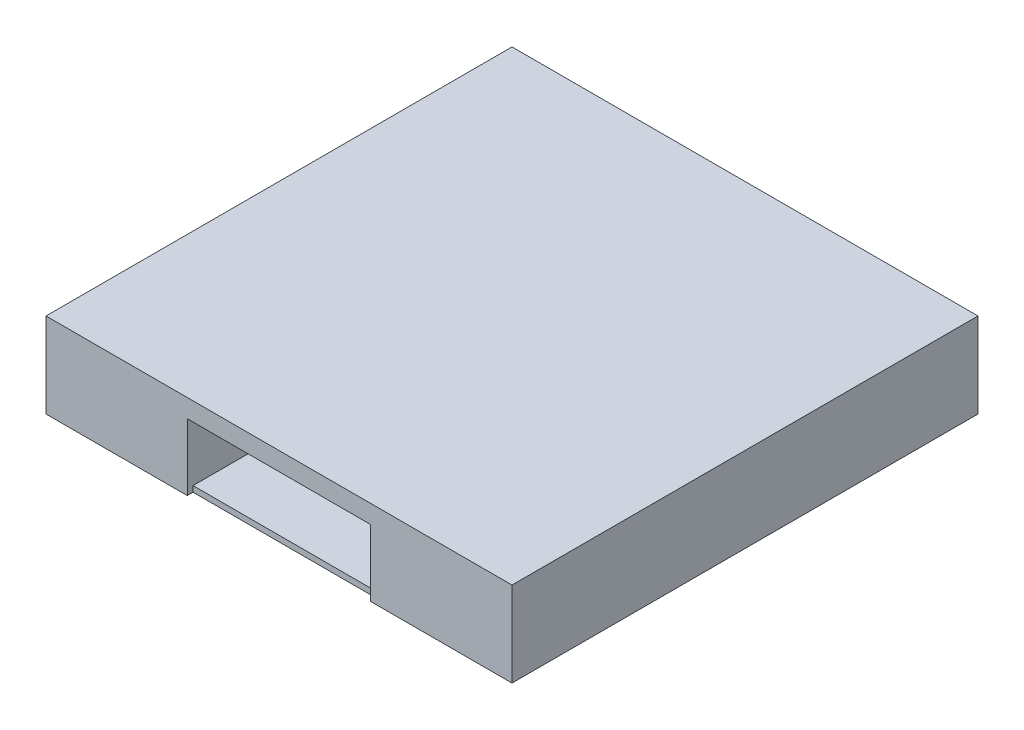
ISO-10303-21;
HEADER;
FILE_DESCRIPTION(('STEP AP214'),'2;1');
FILE_NAME('part.step','',(''),(''),'','','');
FILE_SCHEMA(('AUTOMOTIVE_DESIGN { 1 0 10303 214 1 1 1 1 }'));
ENDSEC;
DATA;
#1=APPLICATION_CONTEXT('core data for automotive mechanical design processes');
#2=APPLICATION_PROTOCOL_DEFINITION('international standard','automotive_design',2000,#1);
#3=PRODUCT_CONTEXT('',#1,'mechanical');
#4=PRODUCT('Part','Part','',(#3));
#5=PRODUCT_RELATED_PRODUCT_CATEGORY('part','',(#4));
#6=PRODUCT_DEFINITION_FORMATION('','',#4);
#7=PRODUCT_DEFINITION_CONTEXT('part definition',#1,'design');
#8=PRODUCT_DEFINITION('design','',#6,#7);
#9=PRODUCT_DEFINITION_SHAPE('','',#8);
#10=(LENGTH_UNIT() NAMED_UNIT(*) SI_UNIT(.MILLI.,.METRE.));
#11=(NAMED_UNIT(*) PLANE_ANGLE_UNIT() SI_UNIT($,.RADIAN.));
#12=(NAMED_UNIT(*) SI_UNIT($,.STERADIAN.) SOLID_ANGLE_UNIT());
#13=UNCERTAINTY_MEASURE_WITH_UNIT(LENGTH_MEASURE(1.E-05),#10,'distance_accuracy_value','');
#14=(GEOMETRIC_REPRESENTATION_CONTEXT(3) GLOBAL_UNCERTAINTY_ASSIGNED_CONTEXT((#13)) GLOBAL_UNIT_ASSIGNED_CONTEXT((#10,
#11,#12)) REPRESENTATION_CONTEXT('',''));
#15=CARTESIAN_POINT('',(0.,0.,0.));
#16=DIRECTION('',(0.,0.,1.));
#17=DIRECTION('',(1.,0.,0.));
#18=AXIS2_PLACEMENT_3D('',#15,#16,#17);
#19=CARTESIAN_POINT('',(0.,6.3,0.));
#20=DIRECTION('',(0.,-1.,0.));
#21=DIRECTION('',(0.,0.,-1.));
#22=AXIS2_PLACEMENT_3D('',#19,#20,#21);
#23=PLANE('',#22);
#24=DIRECTION('',(1.,0.,0.));
#25=VECTOR('',#24,1.);
#26=CARTESIAN_POINT('',(6.3,6.3,-6.3));
#27=LINE('',#26,#25);
#28=CARTESIAN_POINT('',(154.,6.3,-6.3));
#29=VERTEX_POINT('',#28);
#30=CARTESIAN_POINT('',(354.,6.3,-6.3));
#31=VERTEX_POINT('',#30);
#32=EDGE_CURVE('E220',#29,#31,#27,.T.);
#33=ORIENTED_EDGE('',*,*,#32,.T.);
#34=DIRECTION('',(0.,0.,-1.));
#35=VECTOR('',#34,1.);
#36=CARTESIAN_POINT('',(354.,6.3,0.));
#37=LINE('',#36,#35);
#38=CARTESIAN_POINT('',(354.,6.3,-501.7));
#39=VERTEX_POINT('',#38);
#40=EDGE_CURVE('E560',#31,#39,#37,.T.);
#41=ORIENTED_EDGE('',*,*,#40,.T.);
#42=DIRECTION('',(-1.,0.,0.));
#43=VECTOR('',#42,1.);
#44=CARTESIAN_POINT('',(501.7,6.3,-501.7));
#45=LINE('',#44,#43);
#46=CARTESIAN_POINT('',(154.,6.3,-501.7));
#47=VERTEX_POINT('',#46);
#48=EDGE_CURVE('E226',#39,#47,#45,.T.);
#49=ORIENTED_EDGE('',*,*,#48,.T.);
#50=DIRECTION('',(0.,0.,1.));
#51=VECTOR('',#50,1.);
#52=CARTESIAN_POINT('',(154.,6.3,0.));
#53=LINE('',#52,#51);
#54=EDGE_CURVE('E563',#47,#29,#53,.T.);
#55=ORIENTED_EDGE('',*,*,#54,.T.);
#56=EDGE_LOOP('',(#33,#41,#49,#55));
#57=FACE_BOUND('',#56,.T.);
#58=ADVANCED_FACE('F36',(#57),#23,.F.);
#59=CARTESIAN_POINT('',(501.7,86.3,-501.7));
#60=DIRECTION('',(0.,0.,1.));
#61=DIRECTION('',(1.,0.,0.));
#62=AXIS2_PLACEMENT_3D('',#59,#60,#61);
#63=PLANE('',#62);
#64=DIRECTION('',(0.,-1.,0.));
#65=VECTOR('',#64,1.);
#66=CARTESIAN_POINT('',(354.,86.3,-501.7));
#67=LINE('',#66,#65);
#68=CARTESIAN_POINT('',(354.,86.3,-501.7));
#69=VERTEX_POINT('',#68);
#70=EDGE_CURVE('E612',#69,#39,#67,.T.);
#71=ORIENTED_EDGE('',*,*,#70,.F.);
#72=DIRECTION('',(-1.,0.,0.));
#73=VECTOR('',#72,1.);
#74=CARTESIAN_POINT('',(501.7,86.3,-501.7));
#75=LINE('',#74,#73);
#76=CARTESIAN_POINT('',(154.,86.3,-501.7));
#77=VERTEX_POINT('',#76);
#78=EDGE_CURVE('E207',#69,#77,#75,.T.);
#79=ORIENTED_EDGE('',*,*,#78,.T.);
#80=DIRECTION('',(0.,1.,0.));
#81=VECTOR('',#80,1.);
#82=CARTESIAN_POINT('',(154.,86.3,-501.7));
#83=LINE('',#82,#81);
#84=EDGE_CURVE('E597',#47,#77,#83,.T.);
#85=ORIENTED_EDGE('',*,*,#84,.F.);
#86=ORIENTED_EDGE('',*,*,#48,.F.);
#87=EDGE_LOOP('',(#71,#79,#85,#86));
#88=FACE_BOUND('',#87,.T.);
#89=ADVANCED_FACE('F299',(#88),#63,.T.);
#90=CARTESIAN_POINT('',(6.3,86.3,-6.3));
#91=DIRECTION('',(0.,0.,-1.));
#92=DIRECTION('',(-1.,0.,0.));
#93=AXIS2_PLACEMENT_3D('',#90,#91,#92);
#94=PLANE('',#93);
#95=DIRECTION('',(0.,1.,0.));
#96=VECTOR('',#95,1.);
#97=CARTESIAN_POINT('',(354.,86.3,-6.3));
#98=LINE('',#97,#96);
#99=CARTESIAN_POINT('',(354.,72.6,-6.29999999999997));
#100=VERTEX_POINT('',#99);
#101=CARTESIAN_POINT('',(354.,86.3,-6.3));
#102=VERTEX_POINT('',#101);
#103=EDGE_CURVE('E60',#100,#102,#98,.T.);
#104=ORIENTED_EDGE('',*,*,#103,.F.);
#105=DIRECTION('',(1.,0.,0.));
#106=VECTOR('',#105,1.);
#107=CARTESIAN_POINT('',(154.,72.6,-6.29999999999997));
#108=LINE('',#107,#106);
#109=CARTESIAN_POINT('',(154.,72.6,-6.29999999999997));
#110=VERTEX_POINT('',#109);
#111=EDGE_CURVE('E570',#110,#100,#108,.T.);
#112=ORIENTED_EDGE('',*,*,#111,.F.);
#113=DIRECTION('',(0.,-1.,0.));
#114=VECTOR('',#113,1.);
#115=CARTESIAN_POINT('',(154.,86.3,-6.3));
#116=LINE('',#115,#114);
#117=CARTESIAN_POINT('',(154.,86.3,-6.3));
#118=VERTEX_POINT('',#117);
#119=EDGE_CURVE('E591',#118,#110,#116,.T.);
#120=ORIENTED_EDGE('',*,*,#119,.F.);
#121=DIRECTION('',(1.,0.,0.));
#122=VECTOR('',#121,1.);
#123=CARTESIAN_POINT('',(6.3,86.3,-6.3));
#124=LINE('',#123,#122);
#125=EDGE_CURVE('E192',#118,#102,#124,.T.);
#126=ORIENTED_EDGE('',*,*,#125,.T.);
#127=EDGE_LOOP('',(#104,#112,#120,#126));
#128=FACE_BOUND('',#127,.T.);
#129=ADVANCED_FACE('F308',(#128),#94,.T.);
#130=CARTESIAN_POINT('',(0.,86.3,0.));
#131=DIRECTION('',(0.,1.,0.));
#132=DIRECTION('',(0.,0.,1.));
#133=AXIS2_PLACEMENT_3D('',#130,#131,#132);
#134=PLANE('',#133);
#135=ORIENTED_EDGE('',*,*,#78,.F.);
#136=DIRECTION('',(0.,0.,1.));
#137=VECTOR('',#136,1.);
#138=CARTESIAN_POINT('',(354.,86.3,0.));
#139=LINE('',#138,#137);
#140=EDGE_CURVE('E607',#69,#102,#139,.T.);
#141=ORIENTED_EDGE('',*,*,#140,.T.);
#142=ORIENTED_EDGE('',*,*,#125,.F.);
#143=DIRECTION('',(0.,0.,-1.));
#144=VECTOR('',#143,1.);
#145=CARTESIAN_POINT('',(154.,86.3,0.));
#146=LINE('',#145,#144);
#147=EDGE_CURVE('E592',#118,#77,#146,.T.);
#148=ORIENTED_EDGE('',*,*,#147,.T.);
#149=EDGE_LOOP('',(#135,#141,#142,#148));
#150=FACE_BOUND('',#149,.T.);
#151=ADVANCED_FACE('F343',(#150),#134,.F.);
#152=CARTESIAN_POINT('',(508.,6.3,-6.3));
#153=DIRECTION('',(0.,0.,-1.));
#154=DIRECTION('',(-1.,0.,0.));
#155=AXIS2_PLACEMENT_3D('',#152,#153,#154);
#156=PLANE('',#155);
#157=ORIENTED_EDGE('',*,*,#32,.F.);
#158=DIRECTION('',(0.,1.,0.));
#159=VECTOR('',#158,1.);
#160=CARTESIAN_POINT('',(154.,72.6,-6.29999999999997));
#161=LINE('',#160,#159);
#162=CARTESIAN_POINT('',(154.,0.,-6.3));
#163=VERTEX_POINT('',#162);
#164=EDGE_CURVE('E574',#163,#29,#161,.T.);
#165=ORIENTED_EDGE('',*,*,#164,.F.);
#166=DIRECTION('',(1.,0.,0.));
#167=VECTOR('',#166,1.);
#168=CARTESIAN_POINT('',(508.,0.,-6.3));
#169=LINE('',#168,#167);
#170=CARTESIAN_POINT('',(354.,0.,-6.29999999999999));
#171=VERTEX_POINT('',#170);
#172=EDGE_CURVE('E285',#163,#171,#169,.T.);
#173=ORIENTED_EDGE('',*,*,#172,.T.);
#174=DIRECTION('',(0.,-1.,0.));
#175=VECTOR('',#174,1.);
#176=CARTESIAN_POINT('',(354.,72.6,-6.29999999999997));
#177=LINE('',#176,#175);
#178=EDGE_CURVE('E568',#31,#171,#177,.T.);
#179=ORIENTED_EDGE('',*,*,#178,.F.);
#180=EDGE_LOOP('',(#157,#165,#173,#179));
#181=FACE_BOUND('',#180,.T.);
#182=ADVANCED_FACE('F353',(#181),#156,.F.);
#183=CARTESIAN_POINT('',(154.,72.6,905.45461647727));
#184=DIRECTION('',(1.,0.,0.));
#185=DIRECTION('',(0.,1.,0.));
#186=AXIS2_PLACEMENT_3D('',#183,#184,#185);
#187=PLANE('',#186);
#188=DIRECTION('',(0.,1.,0.));
#189=VECTOR('',#188,1.);
#190=CARTESIAN_POINT('',(154.,72.6,0.));
#191=LINE('',#190,#189);
#192=CARTESIAN_POINT('',(154.,0.,0.));
#193=VERTEX_POINT('',#192);
#194=CARTESIAN_POINT('',(154.,72.6,0.));
#195=VERTEX_POINT('',#194);
#196=EDGE_CURVE('E581',#193,#195,#191,.T.);
#197=ORIENTED_EDGE('',*,*,#196,.F.);
#198=DIRECTION('',(0.,0.,-1.));
#199=VECTOR('',#198,1.);
#200=CARTESIAN_POINT('',(154.,0.,905.45461647727));
#201=LINE('',#200,#199);
#202=EDGE_CURVE('E282',#193,#163,#201,.T.);
#203=ORIENTED_EDGE('',*,*,#202,.T.);
#204=ORIENTED_EDGE('',*,*,#164,.T.);
#205=ORIENTED_EDGE('',*,*,#54,.F.);
#206=ORIENTED_EDGE('',*,*,#84,.T.);
#207=ORIENTED_EDGE('',*,*,#147,.F.);
#208=ORIENTED_EDGE('',*,*,#119,.T.);
#209=DIRECTION('',(0.,0.,-1.));
#210=VECTOR('',#209,1.);
#211=CARTESIAN_POINT('',(154.,72.6,905.45461647727));
#212=LINE('',#211,#210);
#213=EDGE_CURVE('E279',#195,#110,#212,.T.);
#214=ORIENTED_EDGE('',*,*,#213,.F.);
#215=EDGE_LOOP('',(#197,#203,#204,#205,#206,#207,#208,#214));
#216=FACE_BOUND('',#215,.T.);
#217=ADVANCED_FACE('F356',(#216),#187,.T.);
#218=CARTESIAN_POINT('',(154.,72.6,905.45461647727));
#219=DIRECTION('',(0.,-1.,0.));
#220=DIRECTION('',(0.,0.,-1.));
#221=AXIS2_PLACEMENT_3D('',#218,#219,#220);
#222=PLANE('',#221);
#223=DIRECTION('',(1.,0.,0.));
#224=VECTOR('',#223,1.);
#225=CARTESIAN_POINT('',(154.,72.6,0.));
#226=LINE('',#225,#224);
#227=CARTESIAN_POINT('',(354.,72.6,0.));
#228=VERTEX_POINT('',#227);
#229=EDGE_CURVE('E576',#195,#228,#226,.T.);
#230=ORIENTED_EDGE('',*,*,#229,.F.);
#231=ORIENTED_EDGE('',*,*,#213,.T.);
#232=ORIENTED_EDGE('',*,*,#111,.T.);
#233=DIRECTION('',(0.,0.,-1.));
#234=VECTOR('',#233,1.);
#235=CARTESIAN_POINT('',(354.,72.6,905.45461647727));
#236=LINE('',#235,#234);
#237=EDGE_CURVE('E586',#228,#100,#236,.T.);
#238=ORIENTED_EDGE('',*,*,#237,.F.);
#239=EDGE_LOOP('',(#230,#231,#232,#238));
#240=FACE_BOUND('',#239,.T.);
#241=ADVANCED_FACE('F360',(#240),#222,.T.);
#242=CARTESIAN_POINT('',(354.,72.6,905.45461647727));
#243=DIRECTION('',(-1.,0.,0.));
#244=DIRECTION('',(0.,0.,1.));
#245=AXIS2_PLACEMENT_3D('',#242,#243,#244);
#246=PLANE('',#245);
#247=DIRECTION('',(0.,-1.,0.));
#248=VECTOR('',#247,1.);
#249=CARTESIAN_POINT('',(354.,72.6,0.));
#250=LINE('',#249,#248);
#251=CARTESIAN_POINT('',(354.,0.,0.));
#252=VERTEX_POINT('',#251);
#253=EDGE_CURVE('E571',#228,#252,#250,.T.);
#254=ORIENTED_EDGE('',*,*,#253,.F.);
#255=ORIENTED_EDGE('',*,*,#237,.T.);
#256=ORIENTED_EDGE('',*,*,#103,.T.);
#257=ORIENTED_EDGE('',*,*,#140,.F.);
#258=ORIENTED_EDGE('',*,*,#70,.T.);
#259=ORIENTED_EDGE('',*,*,#40,.F.);
#260=ORIENTED_EDGE('',*,*,#178,.T.);
#261=DIRECTION('',(0.,0.,-1.));
#262=VECTOR('',#261,1.);
#263=CARTESIAN_POINT('',(354.,0.,905.45461647727));
#264=LINE('',#263,#262);
#265=EDGE_CURVE('E584',#252,#171,#264,.T.);
#266=ORIENTED_EDGE('',*,*,#265,.F.);
#267=EDGE_LOOP('',(#254,#255,#256,#257,#258,#259,#260,#266));
#268=FACE_BOUND('',#267,.T.);
#269=ADVANCED_FACE('F364',(#268),#246,.T.);
#270=CARTESIAN_POINT('',(508.,6.3,0.));
#271=DIRECTION('',(0.,0.,-1.));
#272=DIRECTION('',(-1.,0.,0.));
#273=AXIS2_PLACEMENT_3D('',#270,#271,#272);
#274=PLANE('',#273);
#275=DIRECTION('',(0.,-1.,0.));
#276=VECTOR('',#275,1.);
#277=CARTESIAN_POINT('',(508.,6.3,0.));
#278=LINE('',#277,#276);
#279=CARTESIAN_POINT('',(508.,92.6,0.));
#280=VERTEX_POINT('',#279);
#281=CARTESIAN_POINT('',(508.,0.,0.));
#282=VERTEX_POINT('',#281);
#283=EDGE_CURVE('E11',#280,#282,#278,.T.);
#284=ORIENTED_EDGE('',*,*,#283,.F.);
#285=DIRECTION('',(1.,0.,0.));
#286=VECTOR('',#285,1.);
#287=CARTESIAN_POINT('',(0.,92.6,0.));
#288=LINE('',#287,#286);
#289=CARTESIAN_POINT('',(0.,92.6,0.));
#290=VERTEX_POINT('',#289);
#291=EDGE_CURVE('E272',#290,#280,#288,.T.);
#292=ORIENTED_EDGE('',*,*,#291,.F.);
#293=DIRECTION('',(0.,-1.,0.));
#294=VECTOR('',#293,1.);
#295=CARTESIAN_POINT('',(0.,6.3,0.));
#296=LINE('',#295,#294);
#297=CARTESIAN_POINT('',(0.,0.,0.));
#298=VERTEX_POINT('',#297);
#299=EDGE_CURVE('E245',#290,#298,#296,.T.);
#300=ORIENTED_EDGE('',*,*,#299,.T.);
#301=DIRECTION('',(1.,0.,0.));
#302=VECTOR('',#301,1.);
#303=CARTESIAN_POINT('',(508.,0.,0.));
#304=LINE('',#303,#302);
#305=EDGE_CURVE('E237',#298,#193,#304,.T.);
#306=ORIENTED_EDGE('',*,*,#305,.T.);
#307=ORIENTED_EDGE('',*,*,#196,.T.);
#308=ORIENTED_EDGE('',*,*,#229,.T.);
#309=ORIENTED_EDGE('',*,*,#253,.T.);
#310=EDGE_CURVE('E236',#252,#282,#304,.T.);
#311=ORIENTED_EDGE('',*,*,#310,.T.);
#312=EDGE_LOOP('',(#284,#292,#300,#306,#307,#308,#309,#311));
#313=FACE_BOUND('',#312,.T.);
#314=ADVANCED_FACE('F38',(#313),#274,.F.);
#315=CARTESIAN_POINT('',(0.,0.,0.));
#316=DIRECTION('',(0.,-1.,0.));
#317=DIRECTION('',(0.,0.,-1.));
#318=AXIS2_PLACEMENT_3D('',#315,#316,#317);
#319=PLANE('',#318);
#320=DIRECTION('',(0.,0.,-1.));
#321=VECTOR('',#320,1.);
#322=CARTESIAN_POINT('',(508.,0.,-508.));
#323=LINE('',#322,#321);
#324=CARTESIAN_POINT('',(508.,0.,-508.));
#325=VERTEX_POINT('',#324);
#326=EDGE_CURVE('E239',#282,#325,#323,.T.);
#327=ORIENTED_EDGE('',*,*,#326,.F.);
#328=ORIENTED_EDGE('',*,*,#310,.F.);
#329=ORIENTED_EDGE('',*,*,#265,.T.);
#330=ORIENTED_EDGE('',*,*,#172,.F.);
#331=ORIENTED_EDGE('',*,*,#202,.F.);
#332=ORIENTED_EDGE('',*,*,#305,.F.);
#333=DIRECTION('',(0.,0.,1.));
#334=VECTOR('',#333,1.);
#335=CARTESIAN_POINT('',(0.,0.,0.));
#336=LINE('',#335,#334);
#337=CARTESIAN_POINT('',(0.,0.,-508.));
#338=VERTEX_POINT('',#337);
#339=EDGE_CURVE('E243',#338,#298,#336,.T.);
#340=ORIENTED_EDGE('',*,*,#339,.F.);
#341=DIRECTION('',(-1.,0.,0.));
#342=VECTOR('',#341,1.);
#343=CARTESIAN_POINT('',(0.,0.,-508.));
#344=LINE('',#343,#342);
#345=EDGE_CURVE('E241',#325,#338,#344,.T.);
#346=ORIENTED_EDGE('',*,*,#345,.F.);
#347=EDGE_LOOP('',(#327,#328,#329,#330,#331,#332,#340,#346));
#348=FACE_BOUND('',#347,.T.);
#349=ADVANCED_FACE('F262',(#348),#319,.T.);
#350=CARTESIAN_POINT('',(508.,6.3,-508.));
#351=DIRECTION('',(-1.,0.,0.));
#352=DIRECTION('',(0.,0.,1.));
#353=AXIS2_PLACEMENT_3D('',#350,#351,#352);
#354=PLANE('',#353);
#355=ORIENTED_EDGE('',*,*,#326,.T.);
#356=DIRECTION('',(0.,-1.,0.));
#357=VECTOR('',#356,1.);
#358=CARTESIAN_POINT('',(508.,6.3,-508.));
#359=LINE('',#358,#357);
#360=CARTESIAN_POINT('',(508.,92.6,-508.));
#361=VERTEX_POINT('',#360);
#362=EDGE_CURVE('E45',#361,#325,#359,.T.);
#363=ORIENTED_EDGE('',*,*,#362,.F.);
#364=DIRECTION('',(0.,0.,-1.));
#365=VECTOR('',#364,1.);
#366=CARTESIAN_POINT('',(508.,92.6,-508.));
#367=LINE('',#366,#365);
#368=EDGE_CURVE('E275',#280,#361,#367,.T.);
#369=ORIENTED_EDGE('',*,*,#368,.F.);
#370=ORIENTED_EDGE('',*,*,#283,.T.);
#371=EDGE_LOOP('',(#355,#363,#369,#370));
#372=FACE_BOUND('',#371,.T.);
#373=ADVANCED_FACE('F288',(#372),#354,.F.);
#374=CARTESIAN_POINT('',(0.,6.3,-508.));
#375=DIRECTION('',(0.,0.,1.));
#376=DIRECTION('',(1.,0.,0.));
#377=AXIS2_PLACEMENT_3D('',#374,#375,#376);
#378=PLANE('',#377);
#379=ORIENTED_EDGE('',*,*,#345,.T.);
#380=DIRECTION('',(0.,-1.,0.));
#381=VECTOR('',#380,1.);
#382=CARTESIAN_POINT('',(0.,6.3,-508.));
#383=LINE('',#382,#381);
#384=CARTESIAN_POINT('',(0.,92.6,-508.));
#385=VERTEX_POINT('',#384);
#386=EDGE_CURVE('E248',#385,#338,#383,.T.);
#387=ORIENTED_EDGE('',*,*,#386,.F.);
#388=DIRECTION('',(-1.,0.,0.));
#389=VECTOR('',#388,1.);
#390=CARTESIAN_POINT('',(0.,92.6,-508.));
#391=LINE('',#390,#389);
#392=EDGE_CURVE('E215',#361,#385,#391,.T.);
#393=ORIENTED_EDGE('',*,*,#392,.F.);
#394=ORIENTED_EDGE('',*,*,#362,.T.);
#395=EDGE_LOOP('',(#379,#387,#393,#394));
#396=FACE_BOUND('',#395,.T.);
#397=ADVANCED_FACE('F254',(#396),#378,.F.);
#398=CARTESIAN_POINT('',(0.,6.3,0.));
#399=DIRECTION('',(1.,0.,0.));
#400=DIRECTION('',(0.,0.,-1.));
#401=AXIS2_PLACEMENT_3D('',#398,#399,#400);
#402=PLANE('',#401);
#403=ORIENTED_EDGE('',*,*,#339,.T.);
#404=ORIENTED_EDGE('',*,*,#299,.F.);
#405=DIRECTION('',(0.,0.,1.));
#406=VECTOR('',#405,1.);
#407=CARTESIAN_POINT('',(0.,92.6,-508.));
#408=LINE('',#407,#406);
#409=EDGE_CURVE('E276',#385,#290,#408,.T.);
#410=ORIENTED_EDGE('',*,*,#409,.F.);
#411=ORIENTED_EDGE('',*,*,#386,.T.);
#412=EDGE_LOOP('',(#403,#404,#410,#411));
#413=FACE_BOUND('',#412,.T.);
#414=ADVANCED_FACE('F267',(#413),#402,.F.);
#415=CARTESIAN_POINT('',(0.,92.6,0.));
#416=DIRECTION('',(0.,1.,0.));
#417=DIRECTION('',(0.,0.,1.));
#418=AXIS2_PLACEMENT_3D('',#415,#416,#417);
#419=PLANE('',#418);
#420=ORIENTED_EDGE('',*,*,#392,.T.);
#421=ORIENTED_EDGE('',*,*,#409,.T.);
#422=ORIENTED_EDGE('',*,*,#291,.T.);
#423=ORIENTED_EDGE('',*,*,#368,.T.);
#424=EDGE_LOOP('',(#420,#421,#422,#423));
#425=FACE_BOUND('',#424,.T.);
#426=ADVANCED_FACE('F278',(#425),#419,.T.);
#427=CLOSED_SHELL('',(#58,#89,#129,#151,#182,#217,#241,#269,#314,#349,#373,#397,#414,#426));
#428=CARTESIAN_POINT('',(501.7,86.3,-6.3));
#429=DIRECTION('',(-1.,0.,0.));
#430=DIRECTION('',(0.,0.,1.));
#431=AXIS2_PLACEMENT_3D('',#428,#429,#430);
#432=PLANE('',#431);
#433=DIRECTION('',(0.,0.,-1.));
#434=VECTOR('',#433,1.);
#435=CARTESIAN_POINT('',(501.7,6.3,-6.3));
#436=LINE('',#435,#434);
#437=CARTESIAN_POINT('',(501.7,6.3,-6.3));
#438=VERTEX_POINT('',#437);
#439=CARTESIAN_POINT('',(501.7,6.3,-501.7));
#440=VERTEX_POINT('',#439);
#441=EDGE_CURVE('E219',#438,#440,#436,.T.);
#442=ORIENTED_EDGE('',*,*,#441,.F.);
#443=DIRECTION('',(0.,-1.,0.));
#444=VECTOR('',#443,1.);
#445=CARTESIAN_POINT('',(501.7,86.3,-6.3));
#446=LINE('',#445,#444);
#447=CARTESIAN_POINT('',(501.7,86.3,-6.3));
#448=VERTEX_POINT('',#447);
#449=EDGE_CURVE('E231',#448,#438,#446,.T.);
#450=ORIENTED_EDGE('',*,*,#449,.F.);
#451=DIRECTION('',(0.,0.,-1.));
#452=VECTOR('',#451,1.);
#453=CARTESIAN_POINT('',(501.7,86.3,-6.3));
#454=LINE('',#453,#452);
#455=CARTESIAN_POINT('',(501.7,86.3,-501.7));
#456=VERTEX_POINT('',#455);
#457=EDGE_CURVE('E190',#448,#456,#454,.T.);
#458=ORIENTED_EDGE('',*,*,#457,.T.);
#459=DIRECTION('',(0.,-1.,0.));
#460=VECTOR('',#459,1.);
#461=CARTESIAN_POINT('',(501.7,86.3,-501.7));
#462=LINE('',#461,#460);
#463=EDGE_CURVE('E229',#456,#440,#462,.T.);
#464=ORIENTED_EDGE('',*,*,#463,.T.);
#465=EDGE_LOOP('',(#442,#450,#458,#464));
#466=FACE_BOUND('',#465,.T.);
#467=ADVANCED_FACE('F348',(#466),#432,.T.);
#468=CARTESIAN_POINT('',(360.3,86.3,-6.3));
#469=VERTEX_POINT('',#468);
#470=EDGE_CURVE('E184',#469,#448,#124,.T.);
#471=ORIENTED_EDGE('',*,*,#470,.F.);
#472=DIRECTION('',(0.,0.,-1.));
#473=VECTOR('',#472,1.);
#474=CARTESIAN_POINT('',(360.3,86.3,0.));
#475=LINE('',#474,#473);
#476=CARTESIAN_POINT('',(360.3,86.3,-501.7));
#477=VERTEX_POINT('',#476);
#478=EDGE_CURVE('E171',#469,#477,#475,.T.);
#479=ORIENTED_EDGE('',*,*,#478,.T.);
#480=EDGE_CURVE('E209',#456,#477,#75,.T.);
#481=ORIENTED_EDGE('',*,*,#480,.F.);
#482=ORIENTED_EDGE('',*,*,#457,.F.);
#483=EDGE_LOOP('',(#471,#479,#481,#482));
#484=FACE_BOUND('',#483,.T.);
#485=ADVANCED_FACE('F188',(#484),#134,.F.);
#486=DIRECTION('',(0.,-1.,0.));
#487=VECTOR('',#486,1.);
#488=CARTESIAN_POINT('',(360.3,86.3,-6.3));
#489=LINE('',#488,#487);
#490=CARTESIAN_POINT('',(360.3,6.3,-6.3));
#491=VERTEX_POINT('',#490);
#492=EDGE_CURVE('E174',#469,#491,#489,.T.);
#493=ORIENTED_EDGE('',*,*,#492,.F.);
#494=ORIENTED_EDGE('',*,*,#470,.T.);
#495=ORIENTED_EDGE('',*,*,#449,.T.);
#496=EDGE_CURVE('E186',#491,#438,#27,.T.);
#497=ORIENTED_EDGE('',*,*,#496,.F.);
#498=EDGE_LOOP('',(#493,#494,#495,#497));
#499=FACE_BOUND('',#498,.T.);
#500=ADVANCED_FACE('F182',(#499),#94,.T.);
#501=DIRECTION('',(0.,1.,0.));
#502=VECTOR('',#501,1.);
#503=CARTESIAN_POINT('',(360.3,86.3,-501.7));
#504=LINE('',#503,#502);
#505=CARTESIAN_POINT('',(360.3,6.3,-501.7));
#506=VERTEX_POINT('',#505);
#507=EDGE_CURVE('E52',#506,#477,#504,.T.);
#508=ORIENTED_EDGE('',*,*,#507,.F.);
#509=EDGE_CURVE('E198',#440,#506,#45,.T.);
#510=ORIENTED_EDGE('',*,*,#509,.F.);
#511=ORIENTED_EDGE('',*,*,#463,.F.);
#512=ORIENTED_EDGE('',*,*,#480,.T.);
#513=EDGE_LOOP('',(#508,#510,#511,#512));
#514=FACE_BOUND('',#513,.T.);
#515=ADVANCED_FACE('F311',(#514),#63,.T.);
#516=ORIENTED_EDGE('',*,*,#509,.T.);
#517=DIRECTION('',(0.,0.,1.));
#518=VECTOR('',#517,1.);
#519=CARTESIAN_POINT('',(360.3,6.3,0.));
#520=LINE('',#519,#518);
#521=EDGE_CURVE('E554',#506,#491,#520,.T.);
#522=ORIENTED_EDGE('',*,*,#521,.T.);
#523=ORIENTED_EDGE('',*,*,#496,.T.);
#524=ORIENTED_EDGE('',*,*,#441,.T.);
#525=EDGE_LOOP('',(#516,#522,#523,#524));
#526=FACE_BOUND('',#525,.T.);
#527=ADVANCED_FACE('F302',(#526),#23,.F.);
#528=CARTESIAN_POINT('',(360.3,92.6,-508.));
#529=DIRECTION('',(1.,0.,0.));
#530=DIRECTION('',(0.,0.,-1.));
#531=AXIS2_PLACEMENT_3D('',#528,#529,#530);
#532=PLANE('',#531);
#533=ORIENTED_EDGE('',*,*,#521,.F.);
#534=ORIENTED_EDGE('',*,*,#507,.T.);
#535=ORIENTED_EDGE('',*,*,#478,.F.);
#536=ORIENTED_EDGE('',*,*,#492,.T.);
#537=EDGE_LOOP('',(#533,#534,#535,#536));
#538=FACE_BOUND('',#537,.T.);
#539=ADVANCED_FACE('F173',(#538),#532,.T.);
#540=CLOSED_SHELL('',(#467,#485,#500,#515,#527,#539));
#541=CARTESIAN_POINT('',(6.3,86.3,-501.7));
#542=DIRECTION('',(1.,0.,0.));
#543=DIRECTION('',(0.,0.,-1.));
#544=AXIS2_PLACEMENT_3D('',#541,#542,#543);
#545=PLANE('',#544);
#546=DIRECTION('',(0.,0.,1.));
#547=VECTOR('',#546,1.);
#548=CARTESIAN_POINT('',(6.3,6.3,-501.7));
#549=LINE('',#548,#547);
#550=CARTESIAN_POINT('',(6.3,6.3,-501.7));
#551=VERTEX_POINT('',#550);
#552=CARTESIAN_POINT('',(6.3,6.3,-6.3));
#553=VERTEX_POINT('',#552);
#554=EDGE_CURVE('E212',#551,#553,#549,.T.);
#555=ORIENTED_EDGE('',*,*,#554,.F.);
#556=DIRECTION('',(0.,-1.,0.));
#557=VECTOR('',#556,1.);
#558=CARTESIAN_POINT('',(6.3,86.3,-501.7));
#559=LINE('',#558,#557);
#560=CARTESIAN_POINT('',(6.3,86.3,-501.7));
#561=VERTEX_POINT('',#560);
#562=EDGE_CURVE('E211',#561,#551,#559,.T.);
#563=ORIENTED_EDGE('',*,*,#562,.F.);
#564=DIRECTION('',(0.,0.,1.));
#565=VECTOR('',#564,1.);
#566=CARTESIAN_POINT('',(6.3,86.3,-501.7));
#567=LINE('',#566,#565);
#568=CARTESIAN_POINT('',(6.3,86.3,-6.3));
#569=VERTEX_POINT('',#568);
#570=EDGE_CURVE('E193',#561,#569,#567,.T.);
#571=ORIENTED_EDGE('',*,*,#570,.T.);
#572=DIRECTION('',(0.,-1.,0.));
#573=VECTOR('',#572,1.);
#574=CARTESIAN_POINT('',(6.3,86.3,-6.3));
#575=LINE('',#574,#573);
#576=EDGE_CURVE('E233',#569,#553,#575,.T.);
#577=ORIENTED_EDGE('',*,*,#576,.T.);
#578=EDGE_LOOP('',(#555,#563,#571,#577));
#579=FACE_BOUND('',#578,.T.);
#580=ADVANCED_FACE('F332',(#579),#545,.T.);
#581=CARTESIAN_POINT('',(147.7,86.3,-501.7));
#582=VERTEX_POINT('',#581);
#583=EDGE_CURVE('E205',#582,#561,#75,.T.);
#584=ORIENTED_EDGE('',*,*,#583,.F.);
#585=DIRECTION('',(0.,0.,1.));
#586=VECTOR('',#585,1.);
#587=CARTESIAN_POINT('',(147.7,86.3,0.));
#588=LINE('',#587,#586);
#589=CARTESIAN_POINT('',(147.7,86.3,-6.3));
#590=VERTEX_POINT('',#589);
#591=EDGE_CURVE('E618',#582,#590,#588,.T.);
#592=ORIENTED_EDGE('',*,*,#591,.T.);
#593=EDGE_CURVE('E195',#569,#590,#124,.T.);
#594=ORIENTED_EDGE('',*,*,#593,.F.);
#595=ORIENTED_EDGE('',*,*,#570,.F.);
#596=EDGE_LOOP('',(#584,#592,#594,#595));
#597=FACE_BOUND('',#596,.T.);
#598=ADVANCED_FACE('F335',(#597),#134,.F.);
#599=DIRECTION('',(0.,1.,0.));
#600=VECTOR('',#599,1.);
#601=CARTESIAN_POINT('',(147.7,86.3,-6.3));
#602=LINE('',#601,#600);
#603=CARTESIAN_POINT('',(147.7,6.3,-6.3));
#604=VERTEX_POINT('',#603);
#605=EDGE_CURVE('E621',#604,#590,#602,.T.);
#606=ORIENTED_EDGE('',*,*,#605,.F.);
#607=EDGE_CURVE('E216',#553,#604,#27,.T.);
#608=ORIENTED_EDGE('',*,*,#607,.F.);
#609=ORIENTED_EDGE('',*,*,#576,.F.);
#610=ORIENTED_EDGE('',*,*,#593,.T.);
#611=EDGE_LOOP('',(#606,#608,#609,#610));
#612=FACE_BOUND('',#611,.T.);
#613=ADVANCED_FACE('F330',(#612),#94,.T.);
#614=DIRECTION('',(0.,-1.,0.));
#615=VECTOR('',#614,1.);
#616=CARTESIAN_POINT('',(147.7,86.3,-501.7));
#617=LINE('',#616,#615);
#618=CARTESIAN_POINT('',(147.7,6.3,-501.7));
#619=VERTEX_POINT('',#618);
#620=EDGE_CURVE('E622',#582,#619,#617,.T.);
#621=ORIENTED_EDGE('',*,*,#620,.F.);
#622=ORIENTED_EDGE('',*,*,#583,.T.);
#623=ORIENTED_EDGE('',*,*,#562,.T.);
#624=EDGE_CURVE('E223',#619,#551,#45,.T.);
#625=ORIENTED_EDGE('',*,*,#624,.F.);
#626=EDGE_LOOP('',(#621,#622,#623,#625));
#627=FACE_BOUND('',#626,.T.);
#628=ADVANCED_FACE('F312',(#627),#63,.T.);
#629=ORIENTED_EDGE('',*,*,#607,.T.);
#630=DIRECTION('',(0.,0.,-1.));
#631=VECTOR('',#630,1.);
#632=CARTESIAN_POINT('',(147.7,6.3,0.));
#633=LINE('',#632,#631);
#634=EDGE_CURVE('E600',#604,#619,#633,.T.);
#635=ORIENTED_EDGE('',*,*,#634,.T.);
#636=ORIENTED_EDGE('',*,*,#624,.T.);
#637=ORIENTED_EDGE('',*,*,#554,.T.);
#638=EDGE_LOOP('',(#629,#635,#636,#637));
#639=FACE_BOUND('',#638,.T.);
#640=ADVANCED_FACE('F303',(#639),#23,.F.);
#641=CARTESIAN_POINT('',(147.7,0.,-508.));
#642=DIRECTION('',(-1.,0.,0.));
#643=DIRECTION('',(0.,0.,1.));
#644=AXIS2_PLACEMENT_3D('',#641,#642,#643);
#645=PLANE('',#644);
#646=ORIENTED_EDGE('',*,*,#634,.F.);
#647=ORIENTED_EDGE('',*,*,#605,.T.);
#648=ORIENTED_EDGE('',*,*,#591,.F.);
#649=ORIENTED_EDGE('',*,*,#620,.T.);
#650=EDGE_LOOP('',(#646,#647,#648,#649));
#651=FACE_BOUND('',#650,.T.);
#652=ADVANCED_FACE('F319',(#651),#645,.T.);
#653=CLOSED_SHELL('',(#580,#598,#613,#628,#640,#652));
#654=ORIENTED_CLOSED_SHELL('',*,#540,.T.);
#655=ORIENTED_CLOSED_SHELL('',*,#653,.T.);
#656=BREP_WITH_VOIDS('B2',#427,(#654,#655));
#657=ADVANCED_BREP_SHAPE_REPRESENTATION('',(#18,#656),#14);
#658=SHAPE_DEFINITION_REPRESENTATION(#9,#657);
ENDSEC;
END-ISO-10303-21;
